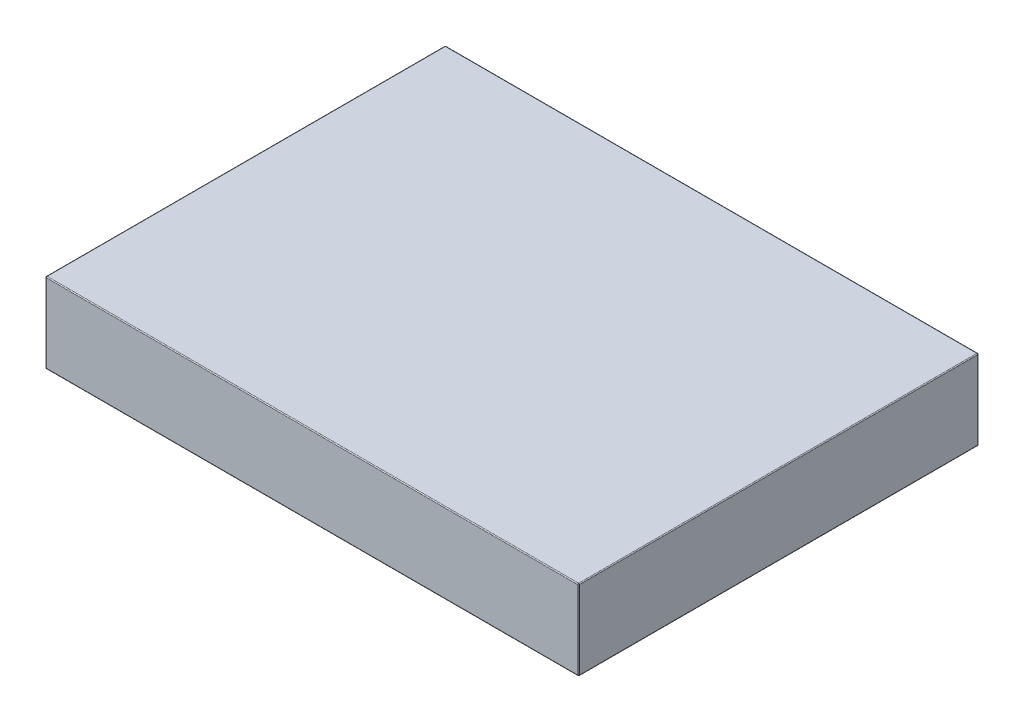
ISO-10303-21;
HEADER;
FILE_DESCRIPTION(('STEP AP214'),'2;1');
FILE_NAME('part.step','',(''),(''),'','','');
FILE_SCHEMA(('AUTOMOTIVE_DESIGN { 1 0 10303 214 1 1 1 1 }'));
ENDSEC;
DATA;
#1=APPLICATION_CONTEXT('core data for automotive mechanical design processes');
#2=APPLICATION_PROTOCOL_DEFINITION('international standard','automotive_design',2000,#1);
#3=PRODUCT_CONTEXT('',#1,'mechanical');
#4=PRODUCT('Part','Part','',(#3));
#5=PRODUCT_RELATED_PRODUCT_CATEGORY('part','',(#4));
#6=PRODUCT_DEFINITION_FORMATION('','',#4);
#7=PRODUCT_DEFINITION_CONTEXT('part definition',#1,'design');
#8=PRODUCT_DEFINITION('design','',#6,#7);
#9=PRODUCT_DEFINITION_SHAPE('','',#8);
#10=(LENGTH_UNIT() NAMED_UNIT(*) SI_UNIT(.MILLI.,.METRE.));
#11=(NAMED_UNIT(*) PLANE_ANGLE_UNIT() SI_UNIT($,.RADIAN.));
#12=(NAMED_UNIT(*) SI_UNIT($,.STERADIAN.) SOLID_ANGLE_UNIT());
#13=UNCERTAINTY_MEASURE_WITH_UNIT(LENGTH_MEASURE(1.E-05),#10,'distance_accuracy_value','');
#14=(GEOMETRIC_REPRESENTATION_CONTEXT(3) GLOBAL_UNCERTAINTY_ASSIGNED_CONTEXT((#13)) GLOBAL_UNIT_ASSIGNED_CONTEXT((#10,
#11,#12)) REPRESENTATION_CONTEXT('',''));
#15=CARTESIAN_POINT('',(0.,0.,0.));
#16=DIRECTION('',(0.,0.,1.));
#17=DIRECTION('',(1.,0.,0.));
#18=AXIS2_PLACEMENT_3D('',#15,#16,#17);
#19=CARTESIAN_POINT('',(76.2,11.43,-57.15));
#20=DIRECTION('',(-1.,0.,0.));
#21=DIRECTION('',(0.,0.,1.));
#22=AXIS2_PLACEMENT_3D('',#19,#20,#21);
#23=PLANE('',#22);
#24=DIRECTION('',(0.,0.,-1.));
#25=VECTOR('',#24,1.);
#26=CARTESIAN_POINT('',(76.2,-11.176,-57.15));
#27=LINE('',#26,#25);
#28=CARTESIAN_POINT('',(76.2,-11.176,56.896));
#29=VERTEX_POINT('',#28);
#30=CARTESIAN_POINT('',(76.2,-11.176,-56.896));
#31=VERTEX_POINT('',#30);
#32=EDGE_CURVE('E253',#29,#31,#27,.T.);
#33=ORIENTED_EDGE('',*,*,#32,.T.);
#34=DIRECTION('',(0.,-1.,0.));
#35=VECTOR('',#34,1.);
#36=CARTESIAN_POINT('',(76.2,11.43,-56.896));
#37=LINE('',#36,#35);
#38=CARTESIAN_POINT('',(76.2,11.176,-56.896));
#39=VERTEX_POINT('',#38);
#40=EDGE_CURVE('E251',#31,#39,#37,.F.);
#41=ORIENTED_EDGE('',*,*,#40,.T.);
#42=DIRECTION('',(0.,0.,-1.));
#43=VECTOR('',#42,1.);
#44=CARTESIAN_POINT('',(76.2,11.176,57.15));
#45=LINE('',#44,#43);
#46=CARTESIAN_POINT('',(76.2,11.176,56.896));
#47=VERTEX_POINT('',#46);
#48=EDGE_CURVE('E243',#39,#47,#45,.F.);
#49=ORIENTED_EDGE('',*,*,#48,.T.);
#50=DIRECTION('',(0.,-1.,0.));
#51=VECTOR('',#50,1.);
#52=CARTESIAN_POINT('',(76.2,11.43,56.896));
#53=LINE('',#52,#51);
#54=EDGE_CURVE('E247',#47,#29,#53,.T.);
#55=ORIENTED_EDGE('',*,*,#54,.T.);
#56=EDGE_LOOP('',(#33,#41,#49,#55));
#57=FACE_BOUND('',#56,.T.);
#58=ADVANCED_FACE('F47',(#57),#23,.F.);
#59=CARTESIAN_POINT('',(-76.2,11.43,-57.15));
#60=DIRECTION('',(0.,0.,1.));
#61=DIRECTION('',(1.,0.,0.));
#62=AXIS2_PLACEMENT_3D('',#59,#60,#61);
#63=PLANE('',#62);
#64=DIRECTION('',(-1.,0.,0.));
#65=VECTOR('',#64,1.);
#66=CARTESIAN_POINT('',(-76.2,-11.176,-57.15));
#67=LINE('',#66,#65);
#68=CARTESIAN_POINT('',(75.946,-11.176,-57.15));
#69=VERTEX_POINT('',#68);
#70=CARTESIAN_POINT('',(-75.946,-11.176,-57.15));
#71=VERTEX_POINT('',#70);
#72=EDGE_CURVE('E334',#69,#71,#67,.T.);
#73=ORIENTED_EDGE('',*,*,#72,.T.);
#74=DIRECTION('',(0.,-1.,0.));
#75=VECTOR('',#74,1.);
#76=CARTESIAN_POINT('',(-75.946,11.43,-57.15));
#77=LINE('',#76,#75);
#78=CARTESIAN_POINT('',(-75.946,11.176,-57.15));
#79=VERTEX_POINT('',#78);
#80=EDGE_CURVE('E248',#71,#79,#77,.F.);
#81=ORIENTED_EDGE('',*,*,#80,.T.);
#82=DIRECTION('',(-1.,0.,0.));
#83=VECTOR('',#82,1.);
#84=CARTESIAN_POINT('',(76.2,11.176,-57.15));
#85=LINE('',#84,#83);
#86=CARTESIAN_POINT('',(75.946,11.176,-57.15));
#87=VERTEX_POINT('',#86);
#88=EDGE_CURVE('E325',#79,#87,#85,.F.);
#89=ORIENTED_EDGE('',*,*,#88,.T.);
#90=DIRECTION('',(0.,-1.,0.));
#91=VECTOR('',#90,1.);
#92=CARTESIAN_POINT('',(75.946,11.43,-57.15));
#93=LINE('',#92,#91);
#94=EDGE_CURVE('E328',#87,#69,#93,.T.);
#95=ORIENTED_EDGE('',*,*,#94,.T.);
#96=EDGE_LOOP('',(#73,#81,#89,#95));
#97=FACE_BOUND('',#96,.T.);
#98=ADVANCED_FACE('F366',(#97),#63,.F.);
#99=CARTESIAN_POINT('',(-76.2,11.43,-57.15));
#100=DIRECTION('',(1.,0.,0.));
#101=DIRECTION('',(0.,0.,-1.));
#102=AXIS2_PLACEMENT_3D('',#99,#100,#101);
#103=PLANE('',#102);
#104=DIRECTION('',(0.,-1.,0.));
#105=VECTOR('',#104,1.);
#106=CARTESIAN_POINT('',(-76.2,11.43,-56.896));
#107=LINE('',#106,#105);
#108=CARTESIAN_POINT('',(-76.2,11.176,-56.896));
#109=VERTEX_POINT('',#108);
#110=CARTESIAN_POINT('',(-76.2,-11.176,-56.896));
#111=VERTEX_POINT('',#110);
#112=EDGE_CURVE('E147',#109,#111,#107,.T.);
#113=ORIENTED_EDGE('',*,*,#112,.T.);
#114=DIRECTION('',(0.,0.,1.));
#115=VECTOR('',#114,1.);
#116=CARTESIAN_POINT('',(-76.2,-11.176,-57.15));
#117=LINE('',#116,#115);
#118=CARTESIAN_POINT('',(-76.2,-11.176,56.896));
#119=VERTEX_POINT('',#118);
#120=EDGE_CURVE('E142',#111,#119,#117,.T.);
#121=ORIENTED_EDGE('',*,*,#120,.T.);
#122=DIRECTION('',(0.,-1.,0.));
#123=VECTOR('',#122,1.);
#124=CARTESIAN_POINT('',(-76.2,11.43,56.896));
#125=LINE('',#124,#123);
#126=CARTESIAN_POINT('',(-76.2,11.176,56.896));
#127=VERTEX_POINT('',#126);
#128=EDGE_CURVE('E136',#119,#127,#125,.F.);
#129=ORIENTED_EDGE('',*,*,#128,.T.);
#130=DIRECTION('',(0.,0.,1.));
#131=VECTOR('',#130,1.);
#132=CARTESIAN_POINT('',(-76.2,11.176,-57.15));
#133=LINE('',#132,#131);
#134=EDGE_CURVE('E139',#127,#109,#133,.F.);
#135=ORIENTED_EDGE('',*,*,#134,.T.);
#136=EDGE_LOOP('',(#113,#121,#129,#135));
#137=FACE_BOUND('',#136,.T.);
#138=ADVANCED_FACE('F138',(#137),#103,.F.);
#139=CARTESIAN_POINT('',(-76.2,11.43,57.15));
#140=DIRECTION('',(0.,0.,-1.));
#141=DIRECTION('',(-1.,0.,0.));
#142=AXIS2_PLACEMENT_3D('',#139,#140,#141);
#143=PLANE('',#142);
#144=DIRECTION('',(0.,-1.,0.));
#145=VECTOR('',#144,1.);
#146=CARTESIAN_POINT('',(-75.946,11.43,57.15));
#147=LINE('',#146,#145);
#148=CARTESIAN_POINT('',(-75.946,11.176,57.15));
#149=VERTEX_POINT('',#148);
#150=CARTESIAN_POINT('',(-75.946,-11.176,57.15));
#151=VERTEX_POINT('',#150);
#152=EDGE_CURVE('E171',#149,#151,#147,.T.);
#153=ORIENTED_EDGE('',*,*,#152,.T.);
#154=DIRECTION('',(1.,0.,0.));
#155=VECTOR('',#154,1.);
#156=CARTESIAN_POINT('',(-76.2,-11.176,57.15));
#157=LINE('',#156,#155);
#158=CARTESIAN_POINT('',(75.946,-11.176,57.15));
#159=VERTEX_POINT('',#158);
#160=EDGE_CURVE('E271',#151,#159,#157,.T.);
#161=ORIENTED_EDGE('',*,*,#160,.T.);
#162=DIRECTION('',(0.,-1.,0.));
#163=VECTOR('',#162,1.);
#164=CARTESIAN_POINT('',(75.946,11.43,57.15));
#165=LINE('',#164,#163);
#166=CARTESIAN_POINT('',(75.946,11.176,57.15));
#167=VERTEX_POINT('',#166);
#168=EDGE_CURVE('E262',#159,#167,#165,.F.);
#169=ORIENTED_EDGE('',*,*,#168,.T.);
#170=DIRECTION('',(1.,0.,0.));
#171=VECTOR('',#170,1.);
#172=CARTESIAN_POINT('',(-76.2,11.176,57.15));
#173=LINE('',#172,#171);
#174=EDGE_CURVE('E258',#167,#149,#173,.F.);
#175=ORIENTED_EDGE('',*,*,#174,.T.);
#176=EDGE_LOOP('',(#153,#161,#169,#175));
#177=FACE_BOUND('',#176,.T.);
#178=ADVANCED_FACE('F550',(#177),#143,.F.);
#179=CARTESIAN_POINT('',(0.,11.43,0.));
#180=DIRECTION('',(0.,1.,0.));
#181=DIRECTION('',(0.,0.,1.));
#182=AXIS2_PLACEMENT_3D('',#179,#180,#181);
#183=PLANE('',#182);
#184=DIRECTION('',(0.,0.,1.));
#185=VECTOR('',#184,1.);
#186=CARTESIAN_POINT('',(-75.946,11.43,57.15));
#187=LINE('',#186,#185);
#188=CARTESIAN_POINT('',(-75.946,11.43,-56.896));
#189=VERTEX_POINT('',#188);
#190=CARTESIAN_POINT('',(-75.946,11.43,56.896));
#191=VERTEX_POINT('',#190);
#192=EDGE_CURVE('E57',#189,#191,#187,.T.);
#193=ORIENTED_EDGE('',*,*,#192,.T.);
#194=DIRECTION('',(1.,0.,0.));
#195=VECTOR('',#194,1.);
#196=CARTESIAN_POINT('',(76.2,11.43,56.896));
#197=LINE('',#196,#195);
#198=CARTESIAN_POINT('',(75.946,11.43,56.896));
#199=VERTEX_POINT('',#198);
#200=EDGE_CURVE('E11',#191,#199,#197,.T.);
#201=ORIENTED_EDGE('',*,*,#200,.T.);
#202=DIRECTION('',(0.,0.,-1.));
#203=VECTOR('',#202,1.);
#204=CARTESIAN_POINT('',(75.946,11.43,-57.15));
#205=LINE('',#204,#203);
#206=CARTESIAN_POINT('',(75.946,11.43,-56.896));
#207=VERTEX_POINT('',#206);
#208=EDGE_CURVE('E274',#199,#207,#205,.T.);
#209=ORIENTED_EDGE('',*,*,#208,.T.);
#210=DIRECTION('',(-1.,0.,0.));
#211=VECTOR('',#210,1.);
#212=CARTESIAN_POINT('',(-76.2,11.43,-56.896));
#213=LINE('',#212,#211);
#214=EDGE_CURVE('E68',#207,#189,#213,.T.);
#215=ORIENTED_EDGE('',*,*,#214,.T.);
#216=EDGE_LOOP('',(#193,#201,#209,#215));
#217=FACE_BOUND('',#216,.T.);
#218=ADVANCED_FACE('F542',(#217),#183,.T.);
#219=CARTESIAN_POINT('',(0.,-11.43,0.));
#220=DIRECTION('',(0.,1.,0.));
#221=DIRECTION('',(0.,0.,1.));
#222=AXIS2_PLACEMENT_3D('',#219,#220,#221);
#223=PLANE('',#222);
#224=DIRECTION('',(1.,0.,0.));
#225=VECTOR('',#224,1.);
#226=CARTESIAN_POINT('',(0.,-11.43,56.896));
#227=LINE('',#226,#225);
#228=CARTESIAN_POINT('',(75.946,-11.43,56.896));
#229=VERTEX_POINT('',#228);
#230=CARTESIAN_POINT('',(-75.946,-11.43,56.896));
#231=VERTEX_POINT('',#230);
#232=EDGE_CURVE('E320',#229,#231,#227,.F.);
#233=ORIENTED_EDGE('',*,*,#232,.T.);
#234=DIRECTION('',(0.,0.,1.));
#235=VECTOR('',#234,1.);
#236=CARTESIAN_POINT('',(-75.946,-11.43,0.));
#237=LINE('',#236,#235);
#238=CARTESIAN_POINT('',(-75.946,-11.43,-56.896));
#239=VERTEX_POINT('',#238);
#240=EDGE_CURVE('E314',#231,#239,#237,.F.);
#241=ORIENTED_EDGE('',*,*,#240,.T.);
#242=DIRECTION('',(-1.,0.,0.));
#243=VECTOR('',#242,1.);
#244=CARTESIAN_POINT('',(0.,-11.43,-56.896));
#245=LINE('',#244,#243);
#246=CARTESIAN_POINT('',(75.946,-11.43,-56.896));
#247=VERTEX_POINT('',#246);
#248=EDGE_CURVE('E307',#239,#247,#245,.F.);
#249=ORIENTED_EDGE('',*,*,#248,.T.);
#250=DIRECTION('',(0.,0.,-1.));
#251=VECTOR('',#250,1.);
#252=CARTESIAN_POINT('',(75.946,-11.43,0.));
#253=LINE('',#252,#251);
#254=EDGE_CURVE('E315',#247,#229,#253,.F.);
#255=ORIENTED_EDGE('',*,*,#254,.T.);
#256=EDGE_LOOP('',(#233,#241,#249,#255));
#257=FACE_BOUND('',#256,.T.);
#258=ADVANCED_FACE('F318',(#257),#223,.F.);
#259=CARTESIAN_POINT('',(75.946,11.176,0.));
#260=DIRECTION('',(0.,0.,1.));
#261=DIRECTION('',(1.,0.,0.));
#262=AXIS2_PLACEMENT_3D('',#259,#260,#261);
#263=CYLINDRICAL_SURFACE('',#262,0.254);
#264=CARTESIAN_POINT('',(75.946,11.176,-56.896));
#265=DIRECTION('',(0.,0.,-1.));
#266=DIRECTION('',(-1.,0.,0.));
#267=AXIS2_PLACEMENT_3D('',#264,#265,#266);
#268=CIRCLE('',#267,0.254);
#269=EDGE_CURVE('E51',#207,#39,#268,.T.);
#270=ORIENTED_EDGE('',*,*,#269,.F.);
#271=ORIENTED_EDGE('',*,*,#208,.F.);
#272=CARTESIAN_POINT('',(75.946,11.176,56.896));
#273=DIRECTION('',(0.,0.,1.));
#274=DIRECTION('',(0.,-1.,0.));
#275=AXIS2_PLACEMENT_3D('',#272,#273,#274);
#276=CIRCLE('',#275,0.254);
#277=EDGE_CURVE('E225',#47,#199,#276,.T.);
#278=ORIENTED_EDGE('',*,*,#277,.F.);
#279=ORIENTED_EDGE('',*,*,#48,.F.);
#280=EDGE_LOOP('',(#270,#271,#278,#279));
#281=FACE_BOUND('',#280,.T.);
#282=ADVANCED_FACE('F49',(#281),#263,.T.);
#283=CARTESIAN_POINT('',(75.946,11.176,-56.896));
#284=DIRECTION('',(1.,0.,0.));
#285=DIRECTION('',(0.,0.,-1.));
#286=AXIS2_PLACEMENT_3D('',#283,#284,#285);
#287=SPHERICAL_SURFACE('',#286,0.254);
#288=CARTESIAN_POINT('',(75.946,11.176,-56.896));
#289=DIRECTION('',(1.,0.,0.));
#290=DIRECTION('',(0.,0.,-1.));
#291=AXIS2_PLACEMENT_3D('',#288,#289,#290);
#292=CIRCLE('',#291,0.254);
#293=EDGE_CURVE('E219',#207,#87,#292,.F.);
#294=ORIENTED_EDGE('',*,*,#293,.F.);
#295=ORIENTED_EDGE('',*,*,#269,.T.);
#296=CARTESIAN_POINT('',(75.946,11.176,-56.896));
#297=DIRECTION('',(0.,1.,0.));
#298=DIRECTION('',(0.,0.,1.));
#299=AXIS2_PLACEMENT_3D('',#296,#297,#298);
#300=CIRCLE('',#299,0.254);
#301=EDGE_CURVE('E223',#87,#39,#300,.F.);
#302=ORIENTED_EDGE('',*,*,#301,.F.);
#303=EDGE_LOOP('',(#294,#295,#302));
#304=FACE_BOUND('',#303,.T.);
#305=ADVANCED_FACE('F240',(#304),#287,.T.);
#306=CARTESIAN_POINT('',(75.946,11.176,56.896));
#307=DIRECTION('',(0.,1.,0.));
#308=DIRECTION('',(0.,0.,1.));
#309=AXIS2_PLACEMENT_3D('',#306,#307,#308);
#310=SPHERICAL_SURFACE('',#309,0.254);
#311=CARTESIAN_POINT('',(75.946,11.176,56.896));
#312=DIRECTION('',(0.,1.,0.));
#313=DIRECTION('',(0.,0.,1.));
#314=AXIS2_PLACEMENT_3D('',#311,#312,#313);
#315=CIRCLE('',#314,0.254);
#316=EDGE_CURVE('E212',#47,#167,#315,.F.);
#317=ORIENTED_EDGE('',*,*,#316,.F.);
#318=ORIENTED_EDGE('',*,*,#277,.T.);
#319=CARTESIAN_POINT('',(75.946,11.176,56.896));
#320=DIRECTION('',(1.,0.,0.));
#321=DIRECTION('',(0.,0.,-1.));
#322=AXIS2_PLACEMENT_3D('',#319,#320,#321);
#323=CIRCLE('',#322,0.254);
#324=EDGE_CURVE('E216',#167,#199,#323,.F.);
#325=ORIENTED_EDGE('',*,*,#324,.F.);
#326=EDGE_LOOP('',(#317,#318,#325));
#327=FACE_BOUND('',#326,.T.);
#328=ADVANCED_FACE('F515',(#327),#310,.T.);
#329=CARTESIAN_POINT('',(75.946,11.43,-56.896));
#330=DIRECTION('',(0.,-1.,0.));
#331=DIRECTION('',(0.,0.,-1.));
#332=AXIS2_PLACEMENT_3D('',#329,#330,#331);
#333=CYLINDRICAL_SURFACE('',#332,0.254);
#334=ORIENTED_EDGE('',*,*,#301,.T.);
#335=ORIENTED_EDGE('',*,*,#40,.F.);
#336=CARTESIAN_POINT('',(75.946,-11.176,-56.896));
#337=DIRECTION('',(0.,-1.,0.));
#338=DIRECTION('',(0.,0.,-1.));
#339=AXIS2_PLACEMENT_3D('',#336,#337,#338);
#340=CIRCLE('',#339,0.254);
#341=EDGE_CURVE('E204',#69,#31,#340,.T.);
#342=ORIENTED_EDGE('',*,*,#341,.F.);
#343=ORIENTED_EDGE('',*,*,#94,.F.);
#344=EDGE_LOOP('',(#334,#335,#342,#343));
#345=FACE_BOUND('',#344,.T.);
#346=ADVANCED_FACE('F368',(#345),#333,.T.);
#347=CARTESIAN_POINT('',(0.,11.176,-56.896));
#348=DIRECTION('',(1.,0.,0.));
#349=DIRECTION('',(0.,0.,-1.));
#350=AXIS2_PLACEMENT_3D('',#347,#348,#349);
#351=CYLINDRICAL_SURFACE('',#350,0.254);
#352=ORIENTED_EDGE('',*,*,#293,.T.);
#353=ORIENTED_EDGE('',*,*,#88,.F.);
#354=CARTESIAN_POINT('',(-75.946,11.176,-56.896));
#355=DIRECTION('',(-1.,0.,0.));
#356=DIRECTION('',(0.,0.,1.));
#357=AXIS2_PLACEMENT_3D('',#354,#355,#356);
#358=CIRCLE('',#357,0.254);
#359=EDGE_CURVE('E200',#189,#79,#358,.T.);
#360=ORIENTED_EDGE('',*,*,#359,.F.);
#361=ORIENTED_EDGE('',*,*,#214,.F.);
#362=EDGE_LOOP('',(#352,#353,#360,#361));
#363=FACE_BOUND('',#362,.T.);
#364=ADVANCED_FACE('F499',(#363),#351,.T.);
#365=CARTESIAN_POINT('',(-75.946,11.176,0.));
#366=DIRECTION('',(0.,0.,-1.));
#367=DIRECTION('',(-1.,0.,0.));
#368=AXIS2_PLACEMENT_3D('',#365,#366,#367);
#369=CYLINDRICAL_SURFACE('',#368,0.254);
#370=CARTESIAN_POINT('',(-75.946,11.176,56.896));
#371=DIRECTION('',(0.,0.,1.));
#372=DIRECTION('',(1.,0.,0.));
#373=AXIS2_PLACEMENT_3D('',#370,#371,#372);
#374=CIRCLE('',#373,0.254);
#375=EDGE_CURVE('E153',#191,#127,#374,.T.);
#376=ORIENTED_EDGE('',*,*,#375,.F.);
#377=ORIENTED_EDGE('',*,*,#192,.F.);
#378=CARTESIAN_POINT('',(-75.946,11.176,-56.896));
#379=DIRECTION('',(0.,0.,-1.));
#380=DIRECTION('',(-1.,0.,0.));
#381=AXIS2_PLACEMENT_3D('',#378,#379,#380);
#382=CIRCLE('',#381,0.254);
#383=EDGE_CURVE('E156',#109,#189,#382,.T.);
#384=ORIENTED_EDGE('',*,*,#383,.F.);
#385=ORIENTED_EDGE('',*,*,#134,.F.);
#386=EDGE_LOOP('',(#376,#377,#384,#385));
#387=FACE_BOUND('',#386,.T.);
#388=ADVANCED_FACE('F152',(#387),#369,.T.);
#389=CARTESIAN_POINT('',(0.,11.176,56.896));
#390=DIRECTION('',(-1.,0.,0.));
#391=DIRECTION('',(0.,0.,1.));
#392=AXIS2_PLACEMENT_3D('',#389,#390,#391);
#393=CYLINDRICAL_SURFACE('',#392,0.254);
#394=ORIENTED_EDGE('',*,*,#324,.T.);
#395=ORIENTED_EDGE('',*,*,#200,.F.);
#396=CARTESIAN_POINT('',(-75.946,11.176,56.896));
#397=DIRECTION('',(-1.,0.,0.));
#398=DIRECTION('',(0.,-1.,0.));
#399=AXIS2_PLACEMENT_3D('',#396,#397,#398);
#400=CIRCLE('',#399,0.254);
#401=EDGE_CURVE('E166',#149,#191,#400,.T.);
#402=ORIENTED_EDGE('',*,*,#401,.F.);
#403=ORIENTED_EDGE('',*,*,#174,.F.);
#404=EDGE_LOOP('',(#394,#395,#402,#403));
#405=FACE_BOUND('',#404,.T.);
#406=ADVANCED_FACE('F483',(#405),#393,.T.);
#407=CARTESIAN_POINT('',(75.946,11.43,56.896));
#408=DIRECTION('',(0.,-1.,0.));
#409=DIRECTION('',(0.,0.,-1.));
#410=AXIS2_PLACEMENT_3D('',#407,#408,#409);
#411=CYLINDRICAL_SURFACE('',#410,0.254);
#412=ORIENTED_EDGE('',*,*,#316,.T.);
#413=ORIENTED_EDGE('',*,*,#168,.F.);
#414=CARTESIAN_POINT('',(75.946,-11.176,56.896));
#415=DIRECTION('',(0.,-1.,0.));
#416=DIRECTION('',(0.,0.,-1.));
#417=AXIS2_PLACEMENT_3D('',#414,#415,#416);
#418=CIRCLE('',#417,0.254);
#419=EDGE_CURVE('E192',#29,#159,#418,.T.);
#420=ORIENTED_EDGE('',*,*,#419,.F.);
#421=ORIENTED_EDGE('',*,*,#54,.F.);
#422=EDGE_LOOP('',(#412,#413,#420,#421));
#423=FACE_BOUND('',#422,.T.);
#424=ADVANCED_FACE('F348',(#423),#411,.T.);
#425=CARTESIAN_POINT('',(75.946,-11.176,-57.15));
#426=DIRECTION('',(0.,0.,-1.));
#427=DIRECTION('',(-1.,0.,0.));
#428=AXIS2_PLACEMENT_3D('',#425,#426,#427);
#429=CYLINDRICAL_SURFACE('',#428,0.254);
#430=CARTESIAN_POINT('',(75.946,-11.176,-56.896));
#431=DIRECTION('',(0.,0.,-1.));
#432=DIRECTION('',(-1.,0.,0.));
#433=AXIS2_PLACEMENT_3D('',#430,#431,#432);
#434=CIRCLE('',#433,0.254);
#435=EDGE_CURVE('E208',#31,#247,#434,.T.);
#436=ORIENTED_EDGE('',*,*,#435,.F.);
#437=ORIENTED_EDGE('',*,*,#32,.F.);
#438=CARTESIAN_POINT('',(75.946,-11.176,56.896));
#439=DIRECTION('',(0.,0.,1.));
#440=DIRECTION('',(1.,0.,0.));
#441=AXIS2_PLACEMENT_3D('',#438,#439,#440);
#442=CIRCLE('',#441,0.254);
#443=EDGE_CURVE('E188',#229,#29,#442,.T.);
#444=ORIENTED_EDGE('',*,*,#443,.F.);
#445=ORIENTED_EDGE('',*,*,#254,.F.);
#446=EDGE_LOOP('',(#436,#437,#444,#445));
#447=FACE_BOUND('',#446,.T.);
#448=ADVANCED_FACE('F345',(#447),#429,.T.);
#449=CARTESIAN_POINT('',(75.946,-11.176,-56.896));
#450=DIRECTION('',(1.,0.,0.));
#451=DIRECTION('',(0.,0.,-1.));
#452=AXIS2_PLACEMENT_3D('',#449,#450,#451);
#453=SPHERICAL_SURFACE('',#452,0.254);
#454=ORIENTED_EDGE('',*,*,#341,.T.);
#455=ORIENTED_EDGE('',*,*,#435,.T.);
#456=CARTESIAN_POINT('',(75.946,-11.176,-56.896));
#457=DIRECTION('',(1.,0.,0.));
#458=DIRECTION('',(0.,0.,-1.));
#459=AXIS2_PLACEMENT_3D('',#456,#457,#458);
#460=CIRCLE('',#459,0.254);
#461=EDGE_CURVE('E178',#69,#247,#460,.F.);
#462=ORIENTED_EDGE('',*,*,#461,.F.);
#463=EDGE_LOOP('',(#454,#455,#462));
#464=FACE_BOUND('',#463,.T.);
#465=ADVANCED_FACE('F370',(#464),#453,.T.);
#466=CARTESIAN_POINT('',(-75.946,11.176,-56.896));
#467=DIRECTION('',(0.,1.,0.));
#468=DIRECTION('',(-1.,0.,0.));
#469=AXIS2_PLACEMENT_3D('',#466,#467,#468);
#470=SPHERICAL_SURFACE('',#469,0.254);
#471=ORIENTED_EDGE('',*,*,#383,.T.);
#472=ORIENTED_EDGE('',*,*,#359,.T.);
#473=CARTESIAN_POINT('',(-75.946,11.176,-56.896));
#474=DIRECTION('',(0.,1.,0.));
#475=DIRECTION('',(0.,0.,1.));
#476=AXIS2_PLACEMENT_3D('',#473,#474,#475);
#477=CIRCLE('',#476,0.254);
#478=EDGE_CURVE('E173',#109,#79,#477,.F.);
#479=ORIENTED_EDGE('',*,*,#478,.F.);
#480=EDGE_LOOP('',(#471,#472,#479));
#481=FACE_BOUND('',#480,.T.);
#482=ADVANCED_FACE('F372',(#481),#470,.T.);
#483=CARTESIAN_POINT('',(-75.946,11.176,56.896));
#484=DIRECTION('',(0.,1.,0.));
#485=DIRECTION('',(-1.,0.,0.));
#486=AXIS2_PLACEMENT_3D('',#483,#484,#485);
#487=SPHERICAL_SURFACE('',#486,0.254);
#488=ORIENTED_EDGE('',*,*,#401,.T.);
#489=ORIENTED_EDGE('',*,*,#375,.T.);
#490=CARTESIAN_POINT('',(-75.946,11.176,56.896));
#491=DIRECTION('',(0.,1.,0.));
#492=DIRECTION('',(0.,0.,1.));
#493=AXIS2_PLACEMENT_3D('',#490,#491,#492);
#494=CIRCLE('',#493,0.254);
#495=EDGE_CURVE('E163',#149,#127,#494,.F.);
#496=ORIENTED_EDGE('',*,*,#495,.F.);
#497=EDGE_LOOP('',(#488,#489,#496));
#498=FACE_BOUND('',#497,.T.);
#499=ADVANCED_FACE('F162',(#498),#487,.T.);
#500=CARTESIAN_POINT('',(75.946,-11.176,56.896));
#501=DIRECTION('',(1.,0.,0.));
#502=DIRECTION('',(0.,0.,-1.));
#503=AXIS2_PLACEMENT_3D('',#500,#501,#502);
#504=SPHERICAL_SURFACE('',#503,0.254);
#505=ORIENTED_EDGE('',*,*,#443,.T.);
#506=ORIENTED_EDGE('',*,*,#419,.T.);
#507=CARTESIAN_POINT('',(75.946,-11.176,56.896));
#508=DIRECTION('',(1.,0.,0.));
#509=DIRECTION('',(0.,0.,-1.));
#510=AXIS2_PLACEMENT_3D('',#507,#508,#509);
#511=CIRCLE('',#510,0.254);
#512=EDGE_CURVE('E174',#229,#159,#511,.F.);
#513=ORIENTED_EDGE('',*,*,#512,.F.);
#514=EDGE_LOOP('',(#505,#506,#513));
#515=FACE_BOUND('',#514,.T.);
#516=ADVANCED_FACE('F350',(#515),#504,.T.);
#517=CARTESIAN_POINT('',(-76.2,-11.176,-56.896));
#518=DIRECTION('',(-1.,0.,0.));
#519=DIRECTION('',(0.,0.,1.));
#520=AXIS2_PLACEMENT_3D('',#517,#518,#519);
#521=CYLINDRICAL_SURFACE('',#520,0.254);
#522=ORIENTED_EDGE('',*,*,#461,.T.);
#523=ORIENTED_EDGE('',*,*,#248,.F.);
#524=CARTESIAN_POINT('',(-75.946,-11.176,-56.896));
#525=DIRECTION('',(-1.,0.,0.));
#526=DIRECTION('',(0.,0.,1.));
#527=AXIS2_PLACEMENT_3D('',#524,#525,#526);
#528=CIRCLE('',#527,0.254);
#529=EDGE_CURVE('E181',#71,#239,#528,.T.);
#530=ORIENTED_EDGE('',*,*,#529,.F.);
#531=ORIENTED_EDGE('',*,*,#72,.F.);
#532=EDGE_LOOP('',(#522,#523,#530,#531));
#533=FACE_BOUND('',#532,.T.);
#534=ADVANCED_FACE('F309',(#533),#521,.T.);
#535=CARTESIAN_POINT('',(-75.946,11.43,-56.896));
#536=DIRECTION('',(0.,-1.,0.));
#537=DIRECTION('',(0.,0.,-1.));
#538=AXIS2_PLACEMENT_3D('',#535,#536,#537);
#539=CYLINDRICAL_SURFACE('',#538,0.254);
#540=ORIENTED_EDGE('',*,*,#478,.T.);
#541=ORIENTED_EDGE('',*,*,#80,.F.);
#542=CARTESIAN_POINT('',(-75.946,-11.176,-56.896));
#543=DIRECTION('',(0.,-1.,0.));
#544=DIRECTION('',(0.,0.,-1.));
#545=AXIS2_PLACEMENT_3D('',#542,#543,#544);
#546=CIRCLE('',#545,0.254);
#547=EDGE_CURVE('E294',#111,#71,#546,.T.);
#548=ORIENTED_EDGE('',*,*,#547,.F.);
#549=ORIENTED_EDGE('',*,*,#112,.F.);
#550=EDGE_LOOP('',(#540,#541,#548,#549));
#551=FACE_BOUND('',#550,.T.);
#552=ADVANCED_FACE('F364',(#551),#539,.T.);
#553=CARTESIAN_POINT('',(-75.946,11.43,56.896));
#554=DIRECTION('',(0.,-1.,0.));
#555=DIRECTION('',(0.,0.,-1.));
#556=AXIS2_PLACEMENT_3D('',#553,#554,#555);
#557=CYLINDRICAL_SURFACE('',#556,0.254);
#558=ORIENTED_EDGE('',*,*,#495,.T.);
#559=ORIENTED_EDGE('',*,*,#128,.F.);
#560=CARTESIAN_POINT('',(-75.946,-11.176,56.896));
#561=DIRECTION('',(0.,-1.,0.));
#562=DIRECTION('',(0.,0.,-1.));
#563=AXIS2_PLACEMENT_3D('',#560,#561,#562);
#564=CIRCLE('',#563,0.254);
#565=EDGE_CURVE('E290',#151,#119,#564,.T.);
#566=ORIENTED_EDGE('',*,*,#565,.F.);
#567=ORIENTED_EDGE('',*,*,#152,.F.);
#568=EDGE_LOOP('',(#558,#559,#566,#567));
#569=FACE_BOUND('',#568,.T.);
#570=ADVANCED_FACE('F169',(#569),#557,.T.);
#571=CARTESIAN_POINT('',(-76.2,-11.176,56.896));
#572=DIRECTION('',(1.,0.,0.));
#573=DIRECTION('',(0.,0.,-1.));
#574=AXIS2_PLACEMENT_3D('',#571,#572,#573);
#575=CYLINDRICAL_SURFACE('',#574,0.254);
#576=ORIENTED_EDGE('',*,*,#512,.T.);
#577=ORIENTED_EDGE('',*,*,#160,.F.);
#578=CARTESIAN_POINT('',(-75.946,-11.176,56.896));
#579=DIRECTION('',(-1.,0.,0.));
#580=DIRECTION('',(0.,0.,1.));
#581=AXIS2_PLACEMENT_3D('',#578,#579,#580);
#582=CIRCLE('',#581,0.254);
#583=EDGE_CURVE('E287',#231,#151,#582,.T.);
#584=ORIENTED_EDGE('',*,*,#583,.F.);
#585=ORIENTED_EDGE('',*,*,#232,.F.);
#586=EDGE_LOOP('',(#576,#577,#584,#585));
#587=FACE_BOUND('',#586,.T.);
#588=ADVANCED_FACE('F353',(#587),#575,.T.);
#589=CARTESIAN_POINT('',(-75.946,-11.176,-56.896));
#590=DIRECTION('',(0.,0.,-1.));
#591=DIRECTION('',(-1.,0.,0.));
#592=AXIS2_PLACEMENT_3D('',#589,#590,#591);
#593=SPHERICAL_SURFACE('',#592,0.254);
#594=ORIENTED_EDGE('',*,*,#547,.T.);
#595=ORIENTED_EDGE('',*,*,#529,.T.);
#596=CARTESIAN_POINT('',(-75.946,-11.176,-56.896));
#597=DIRECTION('',(0.,0.,-1.));
#598=DIRECTION('',(-1.,0.,0.));
#599=AXIS2_PLACEMENT_3D('',#596,#597,#598);
#600=CIRCLE('',#599,0.254);
#601=EDGE_CURVE('E284',#111,#239,#600,.F.);
#602=ORIENTED_EDGE('',*,*,#601,.F.);
#603=EDGE_LOOP('',(#594,#595,#602));
#604=FACE_BOUND('',#603,.T.);
#605=ADVANCED_FACE('F303',(#604),#593,.T.);
#606=CARTESIAN_POINT('',(-75.946,-11.176,56.896));
#607=DIRECTION('',(0.,0.,1.));
#608=DIRECTION('',(1.,0.,0.));
#609=AXIS2_PLACEMENT_3D('',#606,#607,#608);
#610=SPHERICAL_SURFACE('',#609,0.254);
#611=ORIENTED_EDGE('',*,*,#583,.T.);
#612=ORIENTED_EDGE('',*,*,#565,.T.);
#613=CARTESIAN_POINT('',(-75.946,-11.176,56.896));
#614=DIRECTION('',(0.,0.,1.));
#615=DIRECTION('',(1.,0.,0.));
#616=AXIS2_PLACEMENT_3D('',#613,#614,#615);
#617=CIRCLE('',#616,0.254);
#618=EDGE_CURVE('E281',#231,#119,#617,.F.);
#619=ORIENTED_EDGE('',*,*,#618,.F.);
#620=EDGE_LOOP('',(#611,#612,#619));
#621=FACE_BOUND('',#620,.T.);
#622=ADVANCED_FACE('F392',(#621),#610,.T.);
#623=CARTESIAN_POINT('',(-75.946,-11.176,-57.15));
#624=DIRECTION('',(0.,0.,1.));
#625=DIRECTION('',(1.,0.,0.));
#626=AXIS2_PLACEMENT_3D('',#623,#624,#625);
#627=CYLINDRICAL_SURFACE('',#626,0.254);
#628=ORIENTED_EDGE('',*,*,#601,.T.);
#629=ORIENTED_EDGE('',*,*,#240,.F.);
#630=ORIENTED_EDGE('',*,*,#618,.T.);
#631=ORIENTED_EDGE('',*,*,#120,.F.);
#632=EDGE_LOOP('',(#628,#629,#630,#631));
#633=FACE_BOUND('',#632,.T.);
#634=ADVANCED_FACE('F389',(#633),#627,.T.);
#635=CLOSED_SHELL('',(#58,#98,#138,#178,#218,#258,#282,#305,#328,#346,#364,#388,#406,#424,#448,
#465,#482,#499,#516,#534,#552,#570,#588,#605,#622,#634));
#636=MANIFOLD_SOLID_BREP('B2',#635);
#637=ADVANCED_BREP_SHAPE_REPRESENTATION('',(#18,#636),#14);
#638=SHAPE_DEFINITION_REPRESENTATION(#9,#637);
ENDSEC;
END-ISO-10303-21;
